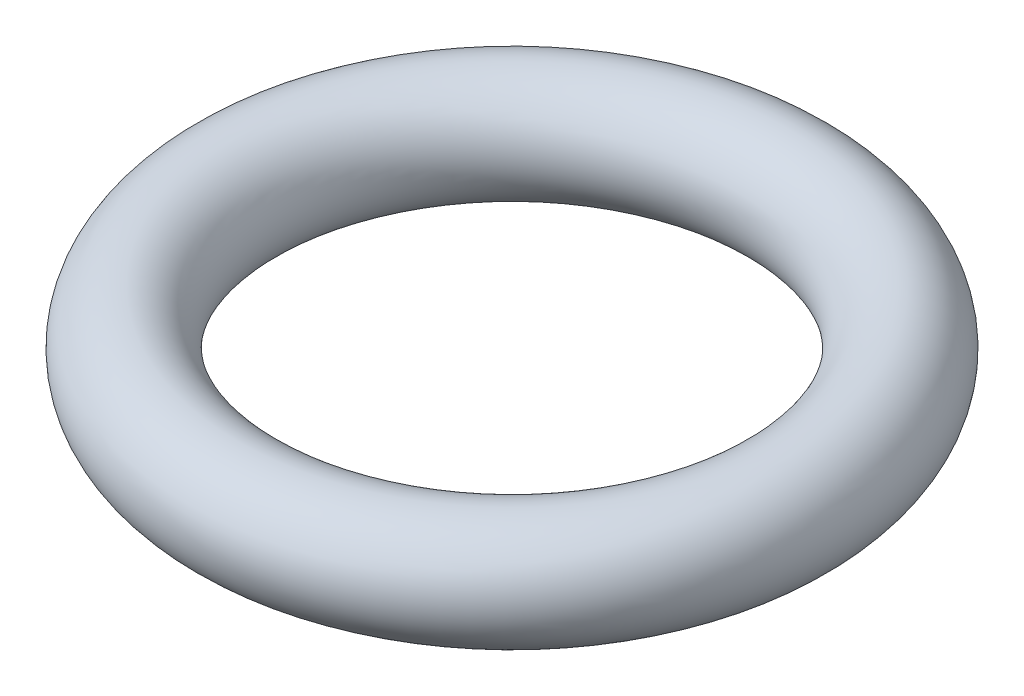
ISO-10303-21;
HEADER;
FILE_DESCRIPTION(('STEP AP214'),'2;1');
FILE_NAME('part.step','',(''),(''),'','','');
FILE_SCHEMA(('AUTOMOTIVE_DESIGN { 1 0 10303 214 1 1 1 1 }'));
ENDSEC;
DATA;
#1=APPLICATION_CONTEXT('core data for automotive mechanical design processes');
#2=APPLICATION_PROTOCOL_DEFINITION('international standard','automotive_design',2000,#1);
#3=PRODUCT_CONTEXT('',#1,'mechanical');
#4=PRODUCT('Part','Part','',(#3));
#5=PRODUCT_RELATED_PRODUCT_CATEGORY('part','',(#4));
#6=PRODUCT_DEFINITION_FORMATION('','',#4);
#7=PRODUCT_DEFINITION_CONTEXT('part definition',#1,'design');
#8=PRODUCT_DEFINITION('design','',#6,#7);
#9=PRODUCT_DEFINITION_SHAPE('','',#8);
#10=(LENGTH_UNIT() NAMED_UNIT(*) SI_UNIT(.MILLI.,.METRE.));
#11=(NAMED_UNIT(*) PLANE_ANGLE_UNIT() SI_UNIT($,.RADIAN.));
#12=(NAMED_UNIT(*) SI_UNIT($,.STERADIAN.) SOLID_ANGLE_UNIT());
#13=UNCERTAINTY_MEASURE_WITH_UNIT(LENGTH_MEASURE(1.E-05),#10,'distance_accuracy_value','');
#14=(GEOMETRIC_REPRESENTATION_CONTEXT(3) GLOBAL_UNCERTAINTY_ASSIGNED_CONTEXT((#13)) GLOBAL_UNIT_ASSIGNED_CONTEXT((#10,
#11,#12)) REPRESENTATION_CONTEXT('',''));
#15=CARTESIAN_POINT('',(0.,0.,0.));
#16=DIRECTION('',(0.,0.,1.));
#17=DIRECTION('',(1.,0.,0.));
#18=AXIS2_PLACEMENT_3D('',#15,#16,#17);
#19=CARTESIAN_POINT('',(0.,0.,0.));
#20=DIRECTION('',(0.,-1.,0.));
#21=DIRECTION('',(0.,0.,-1.));
#22=AXIS2_PLACEMENT_3D('',#19,#20,#21);
#23=TOROIDAL_SURFACE('',#22,4.,0.800000000000001);
#24=CARTESIAN_POINT('',(0.,0.,-4.8));
#25=VERTEX_POINT('',#24);
#26=VERTEX_LOOP('',#25);
#27=FACE_BOUND('',#26,.T.);
#28=ADVANCED_FACE('F29',(#27),#23,.T.);
#29=CLOSED_SHELL('',(#28));
#30=MANIFOLD_SOLID_BREP('B2',#29);
#31=ADVANCED_BREP_SHAPE_REPRESENTATION('',(#18,#30),#14);
#32=SHAPE_DEFINITION_REPRESENTATION(#9,#31);
ENDSEC;
END-ISO-10303-21;
